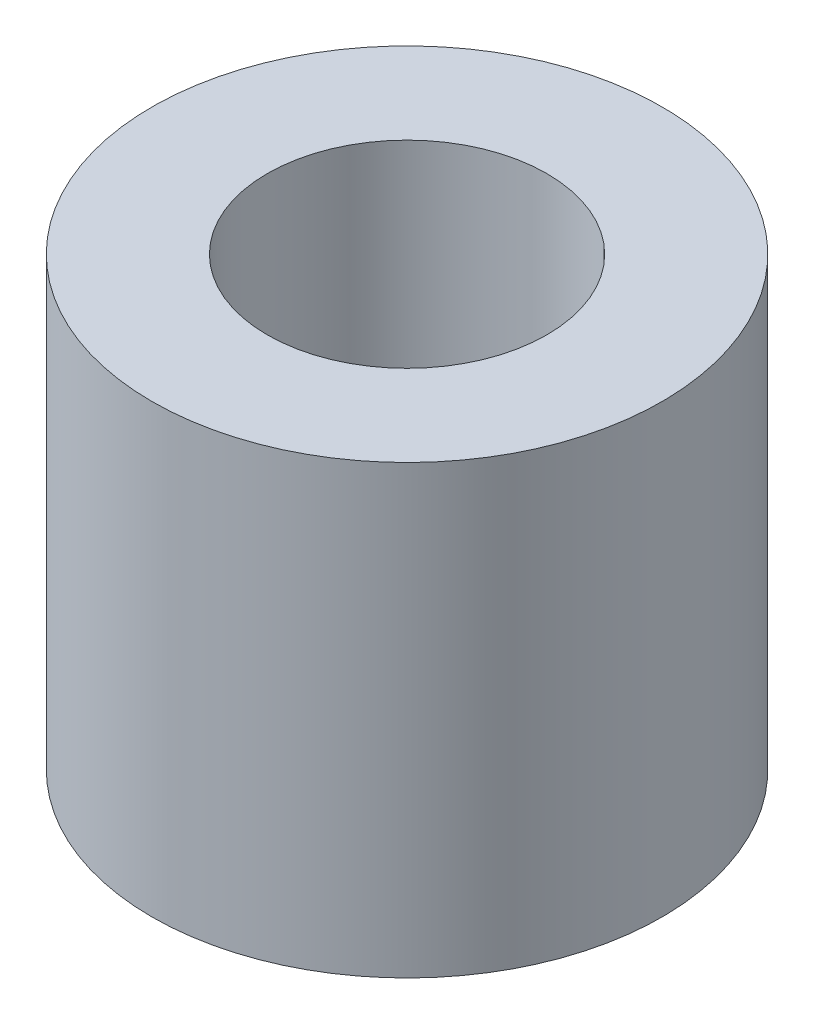
ISO-10303-21;
HEADER;
FILE_DESCRIPTION(('STEP AP214'),'2;1');
FILE_NAME('part.step','',(''),(''),'','','');
FILE_SCHEMA(('AUTOMOTIVE_DESIGN { 1 0 10303 214 1 1 1 1 }'));
ENDSEC;
DATA;
#1=APPLICATION_CONTEXT('core data for automotive mechanical design processes');
#2=APPLICATION_PROTOCOL_DEFINITION('international standard','automotive_design',2000,#1);
#3=PRODUCT_CONTEXT('',#1,'mechanical');
#4=PRODUCT('Part','Part','',(#3));
#5=PRODUCT_RELATED_PRODUCT_CATEGORY('part','',(#4));
#6=PRODUCT_DEFINITION_FORMATION('','',#4);
#7=PRODUCT_DEFINITION_CONTEXT('part definition',#1,'design');
#8=PRODUCT_DEFINITION('design','',#6,#7);
#9=PRODUCT_DEFINITION_SHAPE('','',#8);
#10=(LENGTH_UNIT() NAMED_UNIT(*) SI_UNIT(.MILLI.,.METRE.));
#11=(NAMED_UNIT(*) PLANE_ANGLE_UNIT() SI_UNIT($,.RADIAN.));
#12=(NAMED_UNIT(*) SI_UNIT($,.STERADIAN.) SOLID_ANGLE_UNIT());
#13=UNCERTAINTY_MEASURE_WITH_UNIT(LENGTH_MEASURE(1.E-05),#10,'distance_accuracy_value','');
#14=(GEOMETRIC_REPRESENTATION_CONTEXT(3) GLOBAL_UNCERTAINTY_ASSIGNED_CONTEXT((#13)) GLOBAL_UNIT_ASSIGNED_CONTEXT((#10,
#11,#12)) REPRESENTATION_CONTEXT('',''));
#15=CARTESIAN_POINT('',(0.,0.,0.));
#16=DIRECTION('',(0.,0.,1.));
#17=DIRECTION('',(1.,0.,0.));
#18=AXIS2_PLACEMENT_3D('',#15,#16,#17);
#19=CARTESIAN_POINT('',(0.,7.,0.));
#20=DIRECTION('',(0.,1.,0.));
#21=DIRECTION('',(0.,0.,1.));
#22=AXIS2_PLACEMENT_3D('',#19,#20,#21);
#23=PLANE('',#22);
#24=CARTESIAN_POINT('',(0.,7.,0.));
#25=DIRECTION('',(0.,1.,0.));
#26=DIRECTION('',(0.,0.,1.));
#27=AXIS2_PLACEMENT_3D('',#24,#25,#26);
#28=CIRCLE('',#27,4.);
#29=CARTESIAN_POINT('',(0.,7.,4.));
#30=VERTEX_POINT('',#29);
#31=EDGE_CURVE('E10',#30,#30,#28,.T.);
#32=ORIENTED_EDGE('',*,*,#31,.T.);
#33=EDGE_LOOP('',(#32));
#34=FACE_BOUND('',#33,.T.);
#35=CARTESIAN_POINT('',(0.,7.,0.));
#36=DIRECTION('',(0.,1.,0.));
#37=DIRECTION('',(0.,0.,1.));
#38=AXIS2_PLACEMENT_3D('',#35,#36,#37);
#39=CIRCLE('',#38,2.19143144419724);
#40=CARTESIAN_POINT('',(0.,7.,2.19143144419724));
#41=VERTEX_POINT('',#40);
#42=EDGE_CURVE('E48',#41,#41,#39,.T.);
#43=ORIENTED_EDGE('',*,*,#42,.F.);
#44=EDGE_LOOP('',(#43));
#45=FACE_BOUND('',#44,.T.);
#46=ADVANCED_FACE('F37',(#34,#45),#23,.T.);
#47=CARTESIAN_POINT('',(0.,0.,0.));
#48=DIRECTION('',(0.,1.,0.));
#49=DIRECTION('',(0.,0.,1.));
#50=AXIS2_PLACEMENT_3D('',#47,#48,#49);
#51=PLANE('',#50);
#52=CARTESIAN_POINT('',(0.,0.,0.));
#53=DIRECTION('',(0.,1.,0.));
#54=DIRECTION('',(0.,0.,1.));
#55=AXIS2_PLACEMENT_3D('',#52,#53,#54);
#56=CIRCLE('',#55,4.);
#57=CARTESIAN_POINT('',(0.,0.,4.));
#58=VERTEX_POINT('',#57);
#59=EDGE_CURVE('E41',#58,#58,#56,.T.);
#60=ORIENTED_EDGE('',*,*,#59,.F.);
#61=EDGE_LOOP('',(#60));
#62=FACE_BOUND('',#61,.T.);
#63=CARTESIAN_POINT('',(0.,0.,0.));
#64=DIRECTION('',(0.,1.,0.));
#65=DIRECTION('',(0.,0.,1.));
#66=AXIS2_PLACEMENT_3D('',#63,#64,#65);
#67=CIRCLE('',#66,2.19143144419724);
#68=CARTESIAN_POINT('',(0.,0.,2.19143144419724));
#69=VERTEX_POINT('',#68);
#70=EDGE_CURVE('E50',#69,#69,#67,.T.);
#71=ORIENTED_EDGE('',*,*,#70,.T.);
#72=EDGE_LOOP('',(#71));
#73=FACE_BOUND('',#72,.T.);
#74=ADVANCED_FACE('F60',(#62,#73),#51,.F.);
#75=CARTESIAN_POINT('',(0.,7.,0.));
#76=DIRECTION('',(0.,-1.,0.));
#77=DIRECTION('',(0.,0.,-1.));
#78=AXIS2_PLACEMENT_3D('',#75,#76,#77);
#79=CYLINDRICAL_SURFACE('',#78,4.);
#80=ORIENTED_EDGE('',*,*,#31,.F.);
#81=EDGE_LOOP('',(#80));
#82=FACE_BOUND('',#81,.T.);
#83=ORIENTED_EDGE('',*,*,#59,.T.);
#84=EDGE_LOOP('',(#83));
#85=FACE_BOUND('',#84,.T.);
#86=ADVANCED_FACE('F39',(#82,#85),#79,.T.);
#87=CARTESIAN_POINT('',(0.,7.,0.));
#88=DIRECTION('',(0.,-1.,0.));
#89=DIRECTION('',(0.,0.,-1.));
#90=AXIS2_PLACEMENT_3D('',#87,#88,#89);
#91=CYLINDRICAL_SURFACE('',#90,2.19143144419724);
#92=ORIENTED_EDGE('',*,*,#42,.T.);
#93=EDGE_LOOP('',(#92));
#94=FACE_BOUND('',#93,.T.);
#95=ORIENTED_EDGE('',*,*,#70,.F.);
#96=EDGE_LOOP('',(#95));
#97=FACE_BOUND('',#96,.T.);
#98=ADVANCED_FACE('F56',(#94,#97),#91,.F.);
#99=CLOSED_SHELL('',(#46,#74,#86,#98));
#100=MANIFOLD_SOLID_BREP('B2',#99);
#101=ADVANCED_BREP_SHAPE_REPRESENTATION('',(#18,#100),#14);
#102=SHAPE_DEFINITION_REPRESENTATION(#9,#101);
ENDSEC;
END-ISO-10303-21;
